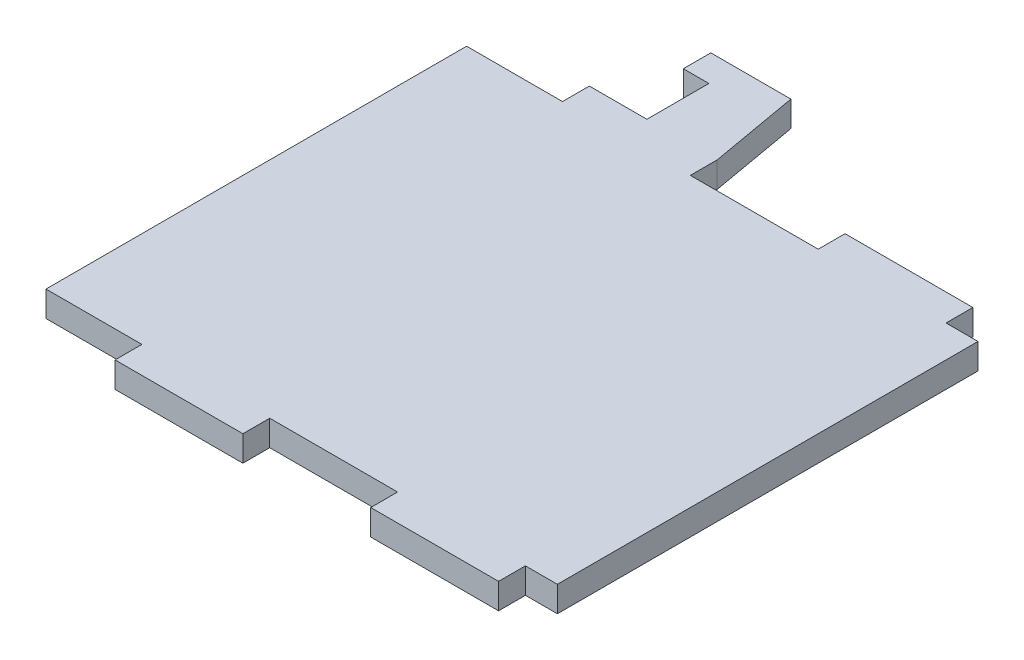
ISO-10303-21;
HEADER;
FILE_DESCRIPTION(('STEP AP214'),'2;1');
FILE_NAME('part.step','',(''),(''),'','','');
FILE_SCHEMA(('AUTOMOTIVE_DESIGN { 1 0 10303 214 1 1 1 1 }'));
ENDSEC;
DATA;
#1=APPLICATION_CONTEXT('core data for automotive mechanical design processes');
#2=APPLICATION_PROTOCOL_DEFINITION('international standard','automotive_design',2000,#1);
#3=PRODUCT_CONTEXT('',#1,'mechanical');
#4=PRODUCT('Part','Part','',(#3));
#5=PRODUCT_RELATED_PRODUCT_CATEGORY('part','',(#4));
#6=PRODUCT_DEFINITION_FORMATION('','',#4);
#7=PRODUCT_DEFINITION_CONTEXT('part definition',#1,'design');
#8=PRODUCT_DEFINITION('design','',#6,#7);
#9=PRODUCT_DEFINITION_SHAPE('','',#8);
#10=(LENGTH_UNIT() NAMED_UNIT(*) SI_UNIT(.MILLI.,.METRE.));
#11=(NAMED_UNIT(*) PLANE_ANGLE_UNIT() SI_UNIT($,.RADIAN.));
#12=(NAMED_UNIT(*) SI_UNIT($,.STERADIAN.) SOLID_ANGLE_UNIT());
#13=UNCERTAINTY_MEASURE_WITH_UNIT(LENGTH_MEASURE(1.E-05),#10,'distance_accuracy_value','');
#14=(GEOMETRIC_REPRESENTATION_CONTEXT(3) GLOBAL_UNCERTAINTY_ASSIGNED_CONTEXT((#13)) GLOBAL_UNIT_ASSIGNED_CONTEXT((#10,
#11,#12)) REPRESENTATION_CONTEXT('',''));
#15=CARTESIAN_POINT('',(0.,0.,0.));
#16=DIRECTION('',(0.,0.,1.));
#17=DIRECTION('',(1.,0.,0.));
#18=AXIS2_PLACEMENT_3D('',#15,#16,#17);
#19=CARTESIAN_POINT('',(75.,4.,-65.8));
#20=DIRECTION('',(0.,0.,1.));
#21=DIRECTION('',(1.,0.,0.));
#22=AXIS2_PLACEMENT_3D('',#19,#20,#21);
#23=PLANE('',#22);
#24=DIRECTION('',(-1.,0.,0.));
#25=VECTOR('',#24,1.);
#26=CARTESIAN_POINT('',(75.,0.,-65.8));
#27=LINE('',#26,#25);
#28=CARTESIAN_POINT('',(80.,0.,-65.8));
#29=VERTEX_POINT('',#28);
#30=CARTESIAN_POINT('',(75.,0.,-65.8));
#31=VERTEX_POINT('',#30);
#32=EDGE_CURVE('E234',#29,#31,#27,.T.);
#33=ORIENTED_EDGE('',*,*,#32,.T.);
#34=DIRECTION('',(0.,-1.,0.));
#35=VECTOR('',#34,1.);
#36=CARTESIAN_POINT('',(75.,4.,-65.8));
#37=LINE('',#36,#35);
#38=CARTESIAN_POINT('',(75.,4.,-65.8));
#39=VERTEX_POINT('',#38);
#40=EDGE_CURVE('E11',#39,#31,#37,.T.);
#41=ORIENTED_EDGE('',*,*,#40,.F.);
#42=DIRECTION('',(-1.,0.,0.));
#43=VECTOR('',#42,1.);
#44=CARTESIAN_POINT('',(75.,4.,-65.8));
#45=LINE('',#44,#43);
#46=CARTESIAN_POINT('',(80.,4.,-65.8));
#47=VERTEX_POINT('',#46);
#48=EDGE_CURVE('E282',#47,#39,#45,.T.);
#49=ORIENTED_EDGE('',*,*,#48,.F.);
#50=DIRECTION('',(0.,-1.,0.));
#51=VECTOR('',#50,1.);
#52=CARTESIAN_POINT('',(80.,4.,-65.8));
#53=LINE('',#52,#51);
#54=EDGE_CURVE('E230',#47,#29,#53,.T.);
#55=ORIENTED_EDGE('',*,*,#54,.T.);
#56=EDGE_LOOP('',(#33,#41,#49,#55));
#57=FACE_BOUND('',#56,.T.);
#58=ADVANCED_FACE('F36',(#57),#23,.F.);
#59=CARTESIAN_POINT('',(75.,4.,-65.8));
#60=DIRECTION('',(-1.,0.,0.));
#61=DIRECTION('',(0.,0.,1.));
#62=AXIS2_PLACEMENT_3D('',#59,#60,#61);
#63=PLANE('',#62);
#64=DIRECTION('',(0.,0.,-1.));
#65=VECTOR('',#64,1.);
#66=CARTESIAN_POINT('',(75.,0.,-65.8));
#67=LINE('',#66,#65);
#68=CARTESIAN_POINT('',(75.,0.,-70.));
#69=VERTEX_POINT('',#68);
#70=EDGE_CURVE('E237',#31,#69,#67,.T.);
#71=ORIENTED_EDGE('',*,*,#70,.T.);
#72=DIRECTION('',(0.,-1.,0.));
#73=VECTOR('',#72,1.);
#74=CARTESIAN_POINT('',(75.,4.,-70.));
#75=LINE('',#74,#73);
#76=CARTESIAN_POINT('',(75.,4.,-70.));
#77=VERTEX_POINT('',#76);
#78=EDGE_CURVE('E44',#77,#69,#75,.T.);
#79=ORIENTED_EDGE('',*,*,#78,.F.);
#80=DIRECTION('',(0.,0.,-1.));
#81=VECTOR('',#80,1.);
#82=CARTESIAN_POINT('',(75.,4.,-65.8));
#83=LINE('',#82,#81);
#84=EDGE_CURVE('E146',#39,#77,#83,.T.);
#85=ORIENTED_EDGE('',*,*,#84,.F.);
#86=ORIENTED_EDGE('',*,*,#40,.T.);
#87=EDGE_LOOP('',(#71,#79,#85,#86));
#88=FACE_BOUND('',#87,.T.);
#89=ADVANCED_FACE('F425',(#88),#63,.F.);
#90=CARTESIAN_POINT('',(75.,4.,-70.));
#91=DIRECTION('',(0.,0.,1.));
#92=DIRECTION('',(1.,0.,0.));
#93=AXIS2_PLACEMENT_3D('',#90,#91,#92);
#94=PLANE('',#93);
#95=DIRECTION('',(-1.,0.,0.));
#96=VECTOR('',#95,1.);
#97=CARTESIAN_POINT('',(75.,0.,-70.));
#98=LINE('',#97,#96);
#99=CARTESIAN_POINT('',(55.,0.,-70.));
#100=VERTEX_POINT('',#99);
#101=EDGE_CURVE('E239',#69,#100,#98,.T.);
#102=ORIENTED_EDGE('',*,*,#101,.T.);
#103=DIRECTION('',(0.,-1.,0.));
#104=VECTOR('',#103,1.);
#105=CARTESIAN_POINT('',(55.,4.,-70.));
#106=LINE('',#105,#104);
#107=CARTESIAN_POINT('',(55.,4.,-70.));
#108=VERTEX_POINT('',#107);
#109=EDGE_CURVE('E340',#108,#100,#106,.T.);
#110=ORIENTED_EDGE('',*,*,#109,.F.);
#111=DIRECTION('',(-1.,0.,0.));
#112=VECTOR('',#111,1.);
#113=CARTESIAN_POINT('',(75.,4.,-70.));
#114=LINE('',#113,#112);
#115=EDGE_CURVE('E348',#77,#108,#114,.T.);
#116=ORIENTED_EDGE('',*,*,#115,.F.);
#117=ORIENTED_EDGE('',*,*,#78,.T.);
#118=EDGE_LOOP('',(#102,#110,#116,#117));
#119=FACE_BOUND('',#118,.T.);
#120=ADVANCED_FACE('F346',(#119),#94,.F.);
#121=CARTESIAN_POINT('',(55.,4.,-65.8));
#122=DIRECTION('',(1.,0.,0.));
#123=DIRECTION('',(0.,0.,-1.));
#124=AXIS2_PLACEMENT_3D('',#121,#122,#123);
#125=PLANE('',#124);
#126=DIRECTION('',(0.,0.,1.));
#127=VECTOR('',#126,1.);
#128=CARTESIAN_POINT('',(55.,0.,-65.8));
#129=LINE('',#128,#127);
#130=CARTESIAN_POINT('',(55.,0.,-65.8));
#131=VERTEX_POINT('',#130);
#132=EDGE_CURVE('E241',#100,#131,#129,.T.);
#133=ORIENTED_EDGE('',*,*,#132,.T.);
#134=DIRECTION('',(0.,-1.,0.));
#135=VECTOR('',#134,1.);
#136=CARTESIAN_POINT('',(55.,4.,-65.8));
#137=LINE('',#136,#135);
#138=CARTESIAN_POINT('',(55.,4.,-65.8));
#139=VERTEX_POINT('',#138);
#140=EDGE_CURVE('E337',#139,#131,#137,.T.);
#141=ORIENTED_EDGE('',*,*,#140,.F.);
#142=DIRECTION('',(0.,0.,1.));
#143=VECTOR('',#142,1.);
#144=CARTESIAN_POINT('',(55.,4.,-65.8));
#145=LINE('',#144,#143);
#146=EDGE_CURVE('E366',#108,#139,#145,.T.);
#147=ORIENTED_EDGE('',*,*,#146,.F.);
#148=ORIENTED_EDGE('',*,*,#109,.T.);
#149=EDGE_LOOP('',(#133,#141,#147,#148));
#150=FACE_BOUND('',#149,.T.);
#151=ADVANCED_FACE('F357',(#150),#125,.F.);
#152=CARTESIAN_POINT('',(35.,4.,-65.8));
#153=DIRECTION('',(0.,0.,1.));
#154=DIRECTION('',(1.,0.,0.));
#155=AXIS2_PLACEMENT_3D('',#152,#153,#154);
#156=PLANE('',#155);
#157=DIRECTION('',(-1.,0.,0.));
#158=VECTOR('',#157,1.);
#159=CARTESIAN_POINT('',(35.,0.,-65.8));
#160=LINE('',#159,#158);
#161=CARTESIAN_POINT('',(35.,0.,-65.8));
#162=VERTEX_POINT('',#161);
#163=EDGE_CURVE('E243',#131,#162,#160,.T.);
#164=ORIENTED_EDGE('',*,*,#163,.T.);
#165=DIRECTION('',(0.,-1.,0.));
#166=VECTOR('',#165,1.);
#167=CARTESIAN_POINT('',(35.,4.,-65.8));
#168=LINE('',#167,#166);
#169=CARTESIAN_POINT('',(35.,4.,-65.8));
#170=VERTEX_POINT('',#169);
#171=EDGE_CURVE('E334',#170,#162,#168,.T.);
#172=ORIENTED_EDGE('',*,*,#171,.F.);
#173=DIRECTION('',(-1.,0.,0.));
#174=VECTOR('',#173,1.);
#175=CARTESIAN_POINT('',(35.,4.,-65.8));
#176=LINE('',#175,#174);
#177=EDGE_CURVE('E363',#139,#170,#176,.T.);
#178=ORIENTED_EDGE('',*,*,#177,.F.);
#179=ORIENTED_EDGE('',*,*,#140,.T.);
#180=EDGE_LOOP('',(#164,#172,#178,#179));
#181=FACE_BOUND('',#180,.T.);
#182=ADVANCED_FACE('F361',(#181),#156,.F.);
#183=CARTESIAN_POINT('',(35.,4.,-65.8));
#184=DIRECTION('',(-1.,0.,0.));
#185=DIRECTION('',(0.,0.,1.));
#186=AXIS2_PLACEMENT_3D('',#183,#184,#185);
#187=PLANE('',#186);
#188=DIRECTION('',(0.,0.,-1.));
#189=VECTOR('',#188,1.);
#190=CARTESIAN_POINT('',(35.,0.,-65.8));
#191=LINE('',#190,#189);
#192=CARTESIAN_POINT('',(35.,0.,-70.));
#193=VERTEX_POINT('',#192);
#194=EDGE_CURVE('E245',#162,#193,#191,.T.);
#195=ORIENTED_EDGE('',*,*,#194,.T.);
#196=DIRECTION('',(0.,-1.,0.));
#197=VECTOR('',#196,1.);
#198=CARTESIAN_POINT('',(35.,4.,-70.));
#199=LINE('',#198,#197);
#200=CARTESIAN_POINT('',(35.,4.,-70.));
#201=VERTEX_POINT('',#200);
#202=EDGE_CURVE('E331',#201,#193,#199,.T.);
#203=ORIENTED_EDGE('',*,*,#202,.F.);
#204=DIRECTION('',(0.,0.,-1.));
#205=VECTOR('',#204,1.);
#206=CARTESIAN_POINT('',(35.,4.,-65.8));
#207=LINE('',#206,#205);
#208=EDGE_CURVE('E365',#170,#201,#207,.T.);
#209=ORIENTED_EDGE('',*,*,#208,.F.);
#210=ORIENTED_EDGE('',*,*,#171,.T.);
#211=EDGE_LOOP('',(#195,#203,#209,#210));
#212=FACE_BOUND('',#211,.T.);
#213=ADVANCED_FACE('F438',(#212),#187,.F.);
#214=CARTESIAN_POINT('',(32.5314222700815,4.,-84.));
#215=DIRECTION('',(-0.984807753012209,0.,0.173648177666927));
#216=DIRECTION('',(0.173648177666927,0.,0.984807753012209));
#217=AXIS2_PLACEMENT_3D('',#214,#215,#216);
#218=PLANE('',#217);
#219=DIRECTION('',(-0.173648177666927,0.,-0.984807753012209));
#220=VECTOR('',#219,1.);
#221=CARTESIAN_POINT('',(32.5314222700815,0.,-84.));
#222=LINE('',#221,#220);
#223=CARTESIAN_POINT('',(32.5314222700815,0.,-84.));
#224=VERTEX_POINT('',#223);
#225=EDGE_CURVE('E247',#193,#224,#222,.T.);
#226=ORIENTED_EDGE('',*,*,#225,.T.);
#227=DIRECTION('',(0.,-1.,0.));
#228=VECTOR('',#227,1.);
#229=CARTESIAN_POINT('',(32.5314222700815,4.,-84.));
#230=LINE('',#229,#228);
#231=CARTESIAN_POINT('',(32.5314222700815,4.,-84.));
#232=VERTEX_POINT('',#231);
#233=EDGE_CURVE('E328',#232,#224,#230,.T.);
#234=ORIENTED_EDGE('',*,*,#233,.F.);
#235=DIRECTION('',(-0.173648177666927,0.,-0.984807753012209));
#236=VECTOR('',#235,1.);
#237=CARTESIAN_POINT('',(32.5314222700815,4.,-84.));
#238=LINE('',#237,#236);
#239=EDGE_CURVE('E368',#201,#232,#238,.T.);
#240=ORIENTED_EDGE('',*,*,#239,.F.);
#241=ORIENTED_EDGE('',*,*,#202,.T.);
#242=EDGE_LOOP('',(#226,#234,#240,#241));
#243=FACE_BOUND('',#242,.T.);
#244=ADVANCED_FACE('F441',(#243),#218,.F.);
#245=CARTESIAN_POINT('',(20.,4.,-84.));
#246=DIRECTION('',(0.,0.,1.));
#247=DIRECTION('',(1.,0.,0.));
#248=AXIS2_PLACEMENT_3D('',#245,#246,#247);
#249=PLANE('',#248);
#250=DIRECTION('',(-1.,0.,0.));
#251=VECTOR('',#250,1.);
#252=CARTESIAN_POINT('',(20.,0.,-84.));
#253=LINE('',#252,#251);
#254=CARTESIAN_POINT('',(20.,0.,-84.));
#255=VERTEX_POINT('',#254);
#256=EDGE_CURVE('E249',#224,#255,#253,.T.);
#257=ORIENTED_EDGE('',*,*,#256,.T.);
#258=DIRECTION('',(0.,-1.,0.));
#259=VECTOR('',#258,1.);
#260=CARTESIAN_POINT('',(20.,4.,-84.));
#261=LINE('',#260,#259);
#262=CARTESIAN_POINT('',(20.,4.,-84.));
#263=VERTEX_POINT('',#262);
#264=EDGE_CURVE('E325',#263,#255,#261,.T.);
#265=ORIENTED_EDGE('',*,*,#264,.F.);
#266=DIRECTION('',(-1.,0.,0.));
#267=VECTOR('',#266,1.);
#268=CARTESIAN_POINT('',(20.,4.,-84.));
#269=LINE('',#268,#267);
#270=EDGE_CURVE('E374',#232,#263,#269,.T.);
#271=ORIENTED_EDGE('',*,*,#270,.F.);
#272=ORIENTED_EDGE('',*,*,#233,.T.);
#273=EDGE_LOOP('',(#257,#265,#271,#272));
#274=FACE_BOUND('',#273,.T.);
#275=ADVANCED_FACE('F445',(#274),#249,.F.);
#276=CARTESIAN_POINT('',(20.,4.,-79.7));
#277=DIRECTION('',(1.,0.,0.));
#278=DIRECTION('',(0.,0.,-1.));
#279=AXIS2_PLACEMENT_3D('',#276,#277,#278);
#280=PLANE('',#279);
#281=DIRECTION('',(0.,0.,1.));
#282=VECTOR('',#281,1.);
#283=CARTESIAN_POINT('',(20.,0.,-79.7));
#284=LINE('',#283,#282);
#285=CARTESIAN_POINT('',(20.,0.,-79.7));
#286=VERTEX_POINT('',#285);
#287=EDGE_CURVE('E251',#255,#286,#284,.T.);
#288=ORIENTED_EDGE('',*,*,#287,.T.);
#289=DIRECTION('',(0.,-1.,0.));
#290=VECTOR('',#289,1.);
#291=CARTESIAN_POINT('',(20.,4.,-79.7));
#292=LINE('',#291,#290);
#293=CARTESIAN_POINT('',(20.,4.,-79.7));
#294=VERTEX_POINT('',#293);
#295=EDGE_CURVE('E322',#294,#286,#292,.T.);
#296=ORIENTED_EDGE('',*,*,#295,.F.);
#297=DIRECTION('',(0.,0.,1.));
#298=VECTOR('',#297,1.);
#299=CARTESIAN_POINT('',(20.,4.,-79.7));
#300=LINE('',#299,#298);
#301=EDGE_CURVE('E376',#263,#294,#300,.T.);
#302=ORIENTED_EDGE('',*,*,#301,.F.);
#303=ORIENTED_EDGE('',*,*,#264,.T.);
#304=EDGE_LOOP('',(#288,#296,#302,#303));
#305=FACE_BOUND('',#304,.T.);
#306=ADVANCED_FACE('F449',(#305),#280,.F.);
#307=CARTESIAN_POINT('',(24.,4.,-79.7));
#308=DIRECTION('',(0.,0.,-1.));
#309=DIRECTION('',(-1.,0.,0.));
#310=AXIS2_PLACEMENT_3D('',#307,#308,#309);
#311=PLANE('',#310);
#312=DIRECTION('',(1.,0.,0.));
#313=VECTOR('',#312,1.);
#314=CARTESIAN_POINT('',(24.,0.,-79.7));
#315=LINE('',#314,#313);
#316=CARTESIAN_POINT('',(24.,0.,-79.7));
#317=VERTEX_POINT('',#316);
#318=EDGE_CURVE('E253',#286,#317,#315,.T.);
#319=ORIENTED_EDGE('',*,*,#318,.T.);
#320=DIRECTION('',(0.,-1.,0.));
#321=VECTOR('',#320,1.);
#322=CARTESIAN_POINT('',(24.,4.,-79.7));
#323=LINE('',#322,#321);
#324=CARTESIAN_POINT('',(24.,4.,-79.7));
#325=VERTEX_POINT('',#324);
#326=EDGE_CURVE('E319',#325,#317,#323,.T.);
#327=ORIENTED_EDGE('',*,*,#326,.F.);
#328=DIRECTION('',(1.,0.,0.));
#329=VECTOR('',#328,1.);
#330=CARTESIAN_POINT('',(24.,4.,-79.7));
#331=LINE('',#330,#329);
#332=EDGE_CURVE('E378',#294,#325,#331,.T.);
#333=ORIENTED_EDGE('',*,*,#332,.F.);
#334=ORIENTED_EDGE('',*,*,#295,.T.);
#335=EDGE_LOOP('',(#319,#327,#333,#334));
#336=FACE_BOUND('',#335,.T.);
#337=ADVANCED_FACE('F453',(#336),#311,.F.);
#338=CARTESIAN_POINT('',(24.,4.,-70.));
#339=DIRECTION('',(1.,0.,0.));
#340=DIRECTION('',(0.,0.,-1.));
#341=AXIS2_PLACEMENT_3D('',#338,#339,#340);
#342=PLANE('',#341);
#343=DIRECTION('',(0.,0.,1.));
#344=VECTOR('',#343,1.);
#345=CARTESIAN_POINT('',(24.,0.,-70.));
#346=LINE('',#345,#344);
#347=CARTESIAN_POINT('',(24.,0.,-70.));
#348=VERTEX_POINT('',#347);
#349=EDGE_CURVE('E255',#317,#348,#346,.T.);
#350=ORIENTED_EDGE('',*,*,#349,.T.);
#351=DIRECTION('',(0.,-1.,0.));
#352=VECTOR('',#351,1.);
#353=CARTESIAN_POINT('',(24.,4.,-70.));
#354=LINE('',#353,#352);
#355=CARTESIAN_POINT('',(24.,4.,-70.));
#356=VERTEX_POINT('',#355);
#357=EDGE_CURVE('E316',#356,#348,#354,.T.);
#358=ORIENTED_EDGE('',*,*,#357,.F.);
#359=DIRECTION('',(0.,0.,1.));
#360=VECTOR('',#359,1.);
#361=CARTESIAN_POINT('',(24.,4.,-70.));
#362=LINE('',#361,#360);
#363=EDGE_CURVE('E380',#325,#356,#362,.T.);
#364=ORIENTED_EDGE('',*,*,#363,.F.);
#365=ORIENTED_EDGE('',*,*,#326,.T.);
#366=EDGE_LOOP('',(#350,#358,#364,#365));
#367=FACE_BOUND('',#366,.T.);
#368=ADVANCED_FACE('F457',(#367),#342,.F.);
#369=CARTESIAN_POINT('',(24.,4.,-70.));
#370=DIRECTION('',(0.,0.,1.));
#371=DIRECTION('',(1.,0.,0.));
#372=AXIS2_PLACEMENT_3D('',#369,#370,#371);
#373=PLANE('',#372);
#374=DIRECTION('',(-1.,0.,0.));
#375=VECTOR('',#374,1.);
#376=CARTESIAN_POINT('',(24.,0.,-70.));
#377=LINE('',#376,#375);
#378=CARTESIAN_POINT('',(15.,0.,-70.));
#379=VERTEX_POINT('',#378);
#380=EDGE_CURVE('E257',#348,#379,#377,.T.);
#381=ORIENTED_EDGE('',*,*,#380,.T.);
#382=DIRECTION('',(0.,-1.,0.));
#383=VECTOR('',#382,1.);
#384=CARTESIAN_POINT('',(15.,4.,-70.));
#385=LINE('',#384,#383);
#386=CARTESIAN_POINT('',(15.,4.,-70.));
#387=VERTEX_POINT('',#386);
#388=EDGE_CURVE('E313',#387,#379,#385,.T.);
#389=ORIENTED_EDGE('',*,*,#388,.F.);
#390=DIRECTION('',(-1.,0.,0.));
#391=VECTOR('',#390,1.);
#392=CARTESIAN_POINT('',(24.,4.,-70.));
#393=LINE('',#392,#391);
#394=EDGE_CURVE('E382',#356,#387,#393,.T.);
#395=ORIENTED_EDGE('',*,*,#394,.F.);
#396=ORIENTED_EDGE('',*,*,#357,.T.);
#397=EDGE_LOOP('',(#381,#389,#395,#396));
#398=FACE_BOUND('',#397,.T.);
#399=ADVANCED_FACE('F461',(#398),#373,.F.);
#400=CARTESIAN_POINT('',(15.,4.,-65.8));
#401=DIRECTION('',(1.,0.,0.));
#402=DIRECTION('',(0.,0.,-1.));
#403=AXIS2_PLACEMENT_3D('',#400,#401,#402);
#404=PLANE('',#403);
#405=DIRECTION('',(0.,0.,1.));
#406=VECTOR('',#405,1.);
#407=CARTESIAN_POINT('',(15.,0.,-65.8));
#408=LINE('',#407,#406);
#409=CARTESIAN_POINT('',(15.,0.,-65.8));
#410=VERTEX_POINT('',#409);
#411=EDGE_CURVE('E259',#379,#410,#408,.T.);
#412=ORIENTED_EDGE('',*,*,#411,.T.);
#413=DIRECTION('',(0.,-1.,0.));
#414=VECTOR('',#413,1.);
#415=CARTESIAN_POINT('',(15.,4.,-65.8));
#416=LINE('',#415,#414);
#417=CARTESIAN_POINT('',(15.,4.,-65.8));
#418=VERTEX_POINT('',#417);
#419=EDGE_CURVE('E310',#418,#410,#416,.T.);
#420=ORIENTED_EDGE('',*,*,#419,.F.);
#421=DIRECTION('',(0.,0.,1.));
#422=VECTOR('',#421,1.);
#423=CARTESIAN_POINT('',(15.,4.,-65.8));
#424=LINE('',#423,#422);
#425=EDGE_CURVE('E384',#387,#418,#424,.T.);
#426=ORIENTED_EDGE('',*,*,#425,.F.);
#427=ORIENTED_EDGE('',*,*,#388,.T.);
#428=EDGE_LOOP('',(#412,#420,#426,#427));
#429=FACE_BOUND('',#428,.T.);
#430=ADVANCED_FACE('F465',(#429),#404,.F.);
#431=CARTESIAN_POINT('',(0.,4.,-65.8));
#432=DIRECTION('',(0.,0.,1.));
#433=DIRECTION('',(1.,0.,0.));
#434=AXIS2_PLACEMENT_3D('',#431,#432,#433);
#435=PLANE('',#434);
#436=DIRECTION('',(-1.,0.,0.));
#437=VECTOR('',#436,1.);
#438=CARTESIAN_POINT('',(0.,0.,-65.8));
#439=LINE('',#438,#437);
#440=CARTESIAN_POINT('',(0.,0.,-65.8));
#441=VERTEX_POINT('',#440);
#442=EDGE_CURVE('E261',#410,#441,#439,.T.);
#443=ORIENTED_EDGE('',*,*,#442,.T.);
#444=DIRECTION('',(0.,-1.,0.));
#445=VECTOR('',#444,1.);
#446=CARTESIAN_POINT('',(0.,4.,-65.8));
#447=LINE('',#446,#445);
#448=CARTESIAN_POINT('',(0.,4.,-65.8));
#449=VERTEX_POINT('',#448);
#450=EDGE_CURVE('E307',#449,#441,#447,.T.);
#451=ORIENTED_EDGE('',*,*,#450,.F.);
#452=DIRECTION('',(-1.,0.,0.));
#453=VECTOR('',#452,1.);
#454=CARTESIAN_POINT('',(0.,4.,-65.8));
#455=LINE('',#454,#453);
#456=EDGE_CURVE('E386',#418,#449,#455,.T.);
#457=ORIENTED_EDGE('',*,*,#456,.F.);
#458=ORIENTED_EDGE('',*,*,#419,.T.);
#459=EDGE_LOOP('',(#443,#451,#457,#458));
#460=FACE_BOUND('',#459,.T.);
#461=ADVANCED_FACE('F469',(#460),#435,.F.);
#462=CARTESIAN_POINT('',(0.,4.,0.));
#463=DIRECTION('',(1.,0.,0.));
#464=DIRECTION('',(0.,0.,-1.));
#465=AXIS2_PLACEMENT_3D('',#462,#463,#464);
#466=PLANE('',#465);
#467=DIRECTION('',(0.,0.,1.));
#468=VECTOR('',#467,1.);
#469=CARTESIAN_POINT('',(0.,0.,0.));
#470=LINE('',#469,#468);
#471=CARTESIAN_POINT('',(0.,0.,0.));
#472=VERTEX_POINT('',#471);
#473=EDGE_CURVE('E263',#441,#472,#470,.T.);
#474=ORIENTED_EDGE('',*,*,#473,.T.);
#475=DIRECTION('',(0.,-1.,0.));
#476=VECTOR('',#475,1.);
#477=CARTESIAN_POINT('',(0.,4.,0.));
#478=LINE('',#477,#476);
#479=CARTESIAN_POINT('',(0.,4.,0.));
#480=VERTEX_POINT('',#479);
#481=EDGE_CURVE('E304',#480,#472,#478,.T.);
#482=ORIENTED_EDGE('',*,*,#481,.F.);
#483=DIRECTION('',(0.,0.,1.));
#484=VECTOR('',#483,1.);
#485=CARTESIAN_POINT('',(0.,4.,0.));
#486=LINE('',#485,#484);
#487=EDGE_CURVE('E388',#449,#480,#486,.T.);
#488=ORIENTED_EDGE('',*,*,#487,.F.);
#489=ORIENTED_EDGE('',*,*,#450,.T.);
#490=EDGE_LOOP('',(#474,#482,#488,#489));
#491=FACE_BOUND('',#490,.T.);
#492=ADVANCED_FACE('F473',(#491),#466,.F.);
#493=CARTESIAN_POINT('',(0.,4.,0.));
#494=DIRECTION('',(0.,0.,-1.));
#495=DIRECTION('',(-1.,0.,0.));
#496=AXIS2_PLACEMENT_3D('',#493,#494,#495);
#497=PLANE('',#496);
#498=DIRECTION('',(1.,0.,0.));
#499=VECTOR('',#498,1.);
#500=CARTESIAN_POINT('',(0.,0.,0.));
#501=LINE('',#500,#499);
#502=CARTESIAN_POINT('',(15.,0.,0.));
#503=VERTEX_POINT('',#502);
#504=EDGE_CURVE('E265',#472,#503,#501,.T.);
#505=ORIENTED_EDGE('',*,*,#504,.T.);
#506=DIRECTION('',(0.,-1.,0.));
#507=VECTOR('',#506,1.);
#508=CARTESIAN_POINT('',(15.,4.,0.));
#509=LINE('',#508,#507);
#510=CARTESIAN_POINT('',(15.,4.,0.));
#511=VERTEX_POINT('',#510);
#512=EDGE_CURVE('E301',#511,#503,#509,.T.);
#513=ORIENTED_EDGE('',*,*,#512,.F.);
#514=DIRECTION('',(1.,0.,0.));
#515=VECTOR('',#514,1.);
#516=CARTESIAN_POINT('',(0.,4.,0.));
#517=LINE('',#516,#515);
#518=EDGE_CURVE('E390',#480,#511,#517,.T.);
#519=ORIENTED_EDGE('',*,*,#518,.F.);
#520=ORIENTED_EDGE('',*,*,#481,.T.);
#521=EDGE_LOOP('',(#505,#513,#519,#520));
#522=FACE_BOUND('',#521,.T.);
#523=ADVANCED_FACE('F477',(#522),#497,.F.);
#524=CARTESIAN_POINT('',(15.,4.,0.));
#525=DIRECTION('',(1.,0.,0.));
#526=DIRECTION('',(0.,0.,-1.));
#527=AXIS2_PLACEMENT_3D('',#524,#525,#526);
#528=PLANE('',#527);
#529=DIRECTION('',(0.,0.,1.));
#530=VECTOR('',#529,1.);
#531=CARTESIAN_POINT('',(15.,0.,0.));
#532=LINE('',#531,#530);
#533=CARTESIAN_POINT('',(15.,0.,4.2));
#534=VERTEX_POINT('',#533);
#535=EDGE_CURVE('E267',#503,#534,#532,.T.);
#536=ORIENTED_EDGE('',*,*,#535,.T.);
#537=DIRECTION('',(0.,-1.,0.));
#538=VECTOR('',#537,1.);
#539=CARTESIAN_POINT('',(15.,4.,4.2));
#540=LINE('',#539,#538);
#541=CARTESIAN_POINT('',(15.,4.,4.2));
#542=VERTEX_POINT('',#541);
#543=EDGE_CURVE('E298',#542,#534,#540,.T.);
#544=ORIENTED_EDGE('',*,*,#543,.F.);
#545=DIRECTION('',(0.,0.,1.));
#546=VECTOR('',#545,1.);
#547=CARTESIAN_POINT('',(15.,4.,0.));
#548=LINE('',#547,#546);
#549=EDGE_CURVE('E392',#511,#542,#548,.T.);
#550=ORIENTED_EDGE('',*,*,#549,.F.);
#551=ORIENTED_EDGE('',*,*,#512,.T.);
#552=EDGE_LOOP('',(#536,#544,#550,#551));
#553=FACE_BOUND('',#552,.T.);
#554=ADVANCED_FACE('F481',(#553),#528,.F.);
#555=CARTESIAN_POINT('',(15.,4.,4.2));
#556=DIRECTION('',(0.,0.,-1.));
#557=DIRECTION('',(-1.,0.,0.));
#558=AXIS2_PLACEMENT_3D('',#555,#556,#557);
#559=PLANE('',#558);
#560=DIRECTION('',(1.,0.,0.));
#561=VECTOR('',#560,1.);
#562=CARTESIAN_POINT('',(15.,0.,4.2));
#563=LINE('',#562,#561);
#564=CARTESIAN_POINT('',(35.,0.,4.2));
#565=VERTEX_POINT('',#564);
#566=EDGE_CURVE('E269',#534,#565,#563,.T.);
#567=ORIENTED_EDGE('',*,*,#566,.T.);
#568=DIRECTION('',(0.,-1.,0.));
#569=VECTOR('',#568,1.);
#570=CARTESIAN_POINT('',(35.,4.,4.2));
#571=LINE('',#570,#569);
#572=CARTESIAN_POINT('',(35.,4.,4.2));
#573=VERTEX_POINT('',#572);
#574=EDGE_CURVE('E295',#573,#565,#571,.T.);
#575=ORIENTED_EDGE('',*,*,#574,.F.);
#576=DIRECTION('',(1.,0.,0.));
#577=VECTOR('',#576,1.);
#578=CARTESIAN_POINT('',(15.,4.,4.2));
#579=LINE('',#578,#577);
#580=EDGE_CURVE('E394',#542,#573,#579,.T.);
#581=ORIENTED_EDGE('',*,*,#580,.F.);
#582=ORIENTED_EDGE('',*,*,#543,.T.);
#583=EDGE_LOOP('',(#567,#575,#581,#582));
#584=FACE_BOUND('',#583,.T.);
#585=ADVANCED_FACE('F485',(#584),#559,.F.);
#586=CARTESIAN_POINT('',(35.,4.,0.));
#587=DIRECTION('',(-1.,0.,0.));
#588=DIRECTION('',(0.,0.,1.));
#589=AXIS2_PLACEMENT_3D('',#586,#587,#588);
#590=PLANE('',#589);
#591=DIRECTION('',(0.,0.,-1.));
#592=VECTOR('',#591,1.);
#593=CARTESIAN_POINT('',(35.,0.,0.));
#594=LINE('',#593,#592);
#595=CARTESIAN_POINT('',(35.,0.,0.));
#596=VERTEX_POINT('',#595);
#597=EDGE_CURVE('E271',#565,#596,#594,.T.);
#598=ORIENTED_EDGE('',*,*,#597,.T.);
#599=DIRECTION('',(0.,-1.,0.));
#600=VECTOR('',#599,1.);
#601=CARTESIAN_POINT('',(35.,4.,0.));
#602=LINE('',#601,#600);
#603=CARTESIAN_POINT('',(35.,4.,0.));
#604=VERTEX_POINT('',#603);
#605=EDGE_CURVE('E292',#604,#596,#602,.T.);
#606=ORIENTED_EDGE('',*,*,#605,.F.);
#607=DIRECTION('',(0.,0.,-1.));
#608=VECTOR('',#607,1.);
#609=CARTESIAN_POINT('',(35.,4.,0.));
#610=LINE('',#609,#608);
#611=EDGE_CURVE('E396',#573,#604,#610,.T.);
#612=ORIENTED_EDGE('',*,*,#611,.F.);
#613=ORIENTED_EDGE('',*,*,#574,.T.);
#614=EDGE_LOOP('',(#598,#606,#612,#613));
#615=FACE_BOUND('',#614,.T.);
#616=ADVANCED_FACE('F489',(#615),#590,.F.);
#617=CARTESIAN_POINT('',(35.,4.,0.));
#618=DIRECTION('',(0.,0.,-1.));
#619=DIRECTION('',(-1.,0.,0.));
#620=AXIS2_PLACEMENT_3D('',#617,#618,#619);
#621=PLANE('',#620);
#622=DIRECTION('',(1.,0.,0.));
#623=VECTOR('',#622,1.);
#624=CARTESIAN_POINT('',(35.,0.,0.));
#625=LINE('',#624,#623);
#626=CARTESIAN_POINT('',(55.,0.,0.));
#627=VERTEX_POINT('',#626);
#628=EDGE_CURVE('E273',#596,#627,#625,.T.);
#629=ORIENTED_EDGE('',*,*,#628,.T.);
#630=DIRECTION('',(0.,-1.,0.));
#631=VECTOR('',#630,1.);
#632=CARTESIAN_POINT('',(55.,4.,0.));
#633=LINE('',#632,#631);
#634=CARTESIAN_POINT('',(55.,4.,0.));
#635=VERTEX_POINT('',#634);
#636=EDGE_CURVE('E289',#635,#627,#633,.T.);
#637=ORIENTED_EDGE('',*,*,#636,.F.);
#638=DIRECTION('',(1.,0.,0.));
#639=VECTOR('',#638,1.);
#640=CARTESIAN_POINT('',(35.,4.,0.));
#641=LINE('',#640,#639);
#642=EDGE_CURVE('E398',#604,#635,#641,.T.);
#643=ORIENTED_EDGE('',*,*,#642,.F.);
#644=ORIENTED_EDGE('',*,*,#605,.T.);
#645=EDGE_LOOP('',(#629,#637,#643,#644));
#646=FACE_BOUND('',#645,.T.);
#647=ADVANCED_FACE('F493',(#646),#621,.F.);
#648=CARTESIAN_POINT('',(55.,4.,0.));
#649=DIRECTION('',(1.,0.,0.));
#650=DIRECTION('',(0.,0.,-1.));
#651=AXIS2_PLACEMENT_3D('',#648,#649,#650);
#652=PLANE('',#651);
#653=DIRECTION('',(0.,0.,1.));
#654=VECTOR('',#653,1.);
#655=CARTESIAN_POINT('',(55.,0.,0.));
#656=LINE('',#655,#654);
#657=CARTESIAN_POINT('',(55.,0.,4.19999999999999));
#658=VERTEX_POINT('',#657);
#659=EDGE_CURVE('E275',#627,#658,#656,.T.);
#660=ORIENTED_EDGE('',*,*,#659,.T.);
#661=DIRECTION('',(0.,-1.,0.));
#662=VECTOR('',#661,1.);
#663=CARTESIAN_POINT('',(55.,4.,4.19999999999999));
#664=LINE('',#663,#662);
#665=CARTESIAN_POINT('',(55.,4.,4.19999999999999));
#666=VERTEX_POINT('',#665);
#667=EDGE_CURVE('E286',#666,#658,#664,.T.);
#668=ORIENTED_EDGE('',*,*,#667,.F.);
#669=DIRECTION('',(0.,0.,1.));
#670=VECTOR('',#669,1.);
#671=CARTESIAN_POINT('',(55.,4.,0.));
#672=LINE('',#671,#670);
#673=EDGE_CURVE('E400',#635,#666,#672,.T.);
#674=ORIENTED_EDGE('',*,*,#673,.F.);
#675=ORIENTED_EDGE('',*,*,#636,.T.);
#676=EDGE_LOOP('',(#660,#668,#674,#675));
#677=FACE_BOUND('',#676,.T.);
#678=ADVANCED_FACE('F406',(#677),#652,.F.);
#679=CARTESIAN_POINT('',(75.,4.,4.19999999999999));
#680=DIRECTION('',(0.,0.,-1.));
#681=DIRECTION('',(-1.,0.,0.));
#682=AXIS2_PLACEMENT_3D('',#679,#680,#681);
#683=PLANE('',#682);
#684=DIRECTION('',(1.,0.,0.));
#685=VECTOR('',#684,1.);
#686=CARTESIAN_POINT('',(75.,0.,4.19999999999999));
#687=LINE('',#686,#685);
#688=CARTESIAN_POINT('',(75.,0.,4.19999999999999));
#689=VERTEX_POINT('',#688);
#690=EDGE_CURVE('E277',#658,#689,#687,.T.);
#691=ORIENTED_EDGE('',*,*,#690,.T.);
#692=DIRECTION('',(0.,-1.,0.));
#693=VECTOR('',#692,1.);
#694=CARTESIAN_POINT('',(75.,4.,4.19999999999999));
#695=LINE('',#694,#693);
#696=CARTESIAN_POINT('',(75.,4.,4.19999999999999));
#697=VERTEX_POINT('',#696);
#698=EDGE_CURVE('E225',#697,#689,#695,.T.);
#699=ORIENTED_EDGE('',*,*,#698,.F.);
#700=DIRECTION('',(1.,0.,0.));
#701=VECTOR('',#700,1.);
#702=CARTESIAN_POINT('',(75.,4.,4.19999999999999));
#703=LINE('',#702,#701);
#704=EDGE_CURVE('E216',#666,#697,#703,.T.);
#705=ORIENTED_EDGE('',*,*,#704,.F.);
#706=ORIENTED_EDGE('',*,*,#667,.T.);
#707=EDGE_LOOP('',(#691,#699,#705,#706));
#708=FACE_BOUND('',#707,.T.);
#709=ADVANCED_FACE('F410',(#708),#683,.F.);
#710=CARTESIAN_POINT('',(75.,4.,0.));
#711=DIRECTION('',(-1.,0.,0.));
#712=DIRECTION('',(0.,0.,1.));
#713=AXIS2_PLACEMENT_3D('',#710,#711,#712);
#714=PLANE('',#713);
#715=DIRECTION('',(0.,0.,-1.));
#716=VECTOR('',#715,1.);
#717=CARTESIAN_POINT('',(75.,0.,0.));
#718=LINE('',#717,#716);
#719=CARTESIAN_POINT('',(75.,0.,0.));
#720=VERTEX_POINT('',#719);
#721=EDGE_CURVE('E224',#689,#720,#718,.T.);
#722=ORIENTED_EDGE('',*,*,#721,.T.);
#723=DIRECTION('',(0.,-1.,0.));
#724=VECTOR('',#723,1.);
#725=CARTESIAN_POINT('',(75.,4.,0.));
#726=LINE('',#725,#724);
#727=CARTESIAN_POINT('',(75.,4.,0.));
#728=VERTEX_POINT('',#727);
#729=EDGE_CURVE('E221',#728,#720,#726,.T.);
#730=ORIENTED_EDGE('',*,*,#729,.F.);
#731=DIRECTION('',(0.,0.,-1.));
#732=VECTOR('',#731,1.);
#733=CARTESIAN_POINT('',(75.,4.,0.));
#734=LINE('',#733,#732);
#735=EDGE_CURVE('E210',#697,#728,#734,.T.);
#736=ORIENTED_EDGE('',*,*,#735,.F.);
#737=ORIENTED_EDGE('',*,*,#698,.T.);
#738=EDGE_LOOP('',(#722,#730,#736,#737));
#739=FACE_BOUND('',#738,.T.);
#740=ADVANCED_FACE('F222',(#739),#714,.F.);
#741=CARTESIAN_POINT('',(75.,4.,0.));
#742=DIRECTION('',(0.,0.,-1.));
#743=DIRECTION('',(-1.,0.,0.));
#744=AXIS2_PLACEMENT_3D('',#741,#742,#743);
#745=PLANE('',#744);
#746=DIRECTION('',(1.,0.,0.));
#747=VECTOR('',#746,1.);
#748=CARTESIAN_POINT('',(75.,0.,0.));
#749=LINE('',#748,#747);
#750=CARTESIAN_POINT('',(80.,0.,0.));
#751=VERTEX_POINT('',#750);
#752=EDGE_CURVE('E132',#720,#751,#749,.T.);
#753=ORIENTED_EDGE('',*,*,#752,.T.);
#754=DIRECTION('',(0.,-1.,0.));
#755=VECTOR('',#754,1.);
#756=CARTESIAN_POINT('',(80.,4.,0.));
#757=LINE('',#756,#755);
#758=CARTESIAN_POINT('',(80.,4.,0.));
#759=VERTEX_POINT('',#758);
#760=EDGE_CURVE('E226',#759,#751,#757,.T.);
#761=ORIENTED_EDGE('',*,*,#760,.F.);
#762=DIRECTION('',(1.,0.,0.));
#763=VECTOR('',#762,1.);
#764=CARTESIAN_POINT('',(75.,4.,0.));
#765=LINE('',#764,#763);
#766=EDGE_CURVE('E214',#728,#759,#765,.T.);
#767=ORIENTED_EDGE('',*,*,#766,.F.);
#768=ORIENTED_EDGE('',*,*,#729,.T.);
#769=EDGE_LOOP('',(#753,#761,#767,#768));
#770=FACE_BOUND('',#769,.T.);
#771=ADVANCED_FACE('F228',(#770),#745,.F.);
#772=CARTESIAN_POINT('',(80.,4.,0.));
#773=DIRECTION('',(-1.,0.,0.));
#774=DIRECTION('',(0.,0.,1.));
#775=AXIS2_PLACEMENT_3D('',#772,#773,#774);
#776=PLANE('',#775);
#777=DIRECTION('',(0.,0.,-1.));
#778=VECTOR('',#777,1.);
#779=CARTESIAN_POINT('',(80.,0.,0.));
#780=LINE('',#779,#778);
#781=EDGE_CURVE('E138',#751,#29,#780,.T.);
#782=ORIENTED_EDGE('',*,*,#781,.T.);
#783=ORIENTED_EDGE('',*,*,#54,.F.);
#784=DIRECTION('',(0.,0.,-1.));
#785=VECTOR('',#784,1.);
#786=CARTESIAN_POINT('',(80.,4.,0.));
#787=LINE('',#786,#785);
#788=EDGE_CURVE('E52',#759,#47,#787,.T.);
#789=ORIENTED_EDGE('',*,*,#788,.F.);
#790=ORIENTED_EDGE('',*,*,#760,.T.);
#791=EDGE_LOOP('',(#782,#783,#789,#790));
#792=FACE_BOUND('',#791,.T.);
#793=ADVANCED_FACE('F414',(#792),#776,.F.);
#794=CARTESIAN_POINT('',(0.,4.,0.));
#795=DIRECTION('',(0.,1.,0.));
#796=DIRECTION('',(0.,0.,1.));
#797=AXIS2_PLACEMENT_3D('',#794,#795,#796);
#798=PLANE('',#797);
#799=ORIENTED_EDGE('',*,*,#48,.T.);
#800=ORIENTED_EDGE('',*,*,#84,.T.);
#801=ORIENTED_EDGE('',*,*,#115,.T.);
#802=ORIENTED_EDGE('',*,*,#146,.T.);
#803=ORIENTED_EDGE('',*,*,#177,.T.);
#804=ORIENTED_EDGE('',*,*,#208,.T.);
#805=ORIENTED_EDGE('',*,*,#239,.T.);
#806=ORIENTED_EDGE('',*,*,#270,.T.);
#807=ORIENTED_EDGE('',*,*,#301,.T.);
#808=ORIENTED_EDGE('',*,*,#332,.T.);
#809=ORIENTED_EDGE('',*,*,#363,.T.);
#810=ORIENTED_EDGE('',*,*,#394,.T.);
#811=ORIENTED_EDGE('',*,*,#425,.T.);
#812=ORIENTED_EDGE('',*,*,#456,.T.);
#813=ORIENTED_EDGE('',*,*,#487,.T.);
#814=ORIENTED_EDGE('',*,*,#518,.T.);
#815=ORIENTED_EDGE('',*,*,#549,.T.);
#816=ORIENTED_EDGE('',*,*,#580,.T.);
#817=ORIENTED_EDGE('',*,*,#611,.T.);
#818=ORIENTED_EDGE('',*,*,#642,.T.);
#819=ORIENTED_EDGE('',*,*,#673,.T.);
#820=ORIENTED_EDGE('',*,*,#704,.T.);
#821=ORIENTED_EDGE('',*,*,#735,.T.);
#822=ORIENTED_EDGE('',*,*,#766,.T.);
#823=ORIENTED_EDGE('',*,*,#788,.T.);
#824=EDGE_LOOP('',(#799,#800,#801,#802,#803,#804,#805,#806,#807,#808,#809,#810,#811,#812,#813,
#814,#815,#816,#817,#818,#819,#820,#821,#822,#823));
#825=FACE_BOUND('',#824,.T.);
#826=ADVANCED_FACE('F212',(#825),#798,.T.);
#827=CARTESIAN_POINT('',(0.,0.,0.));
#828=DIRECTION('',(0.,1.,0.));
#829=DIRECTION('',(0.,0.,1.));
#830=AXIS2_PLACEMENT_3D('',#827,#828,#829);
#831=PLANE('',#830);
#832=ORIENTED_EDGE('',*,*,#32,.F.);
#833=ORIENTED_EDGE('',*,*,#781,.F.);
#834=ORIENTED_EDGE('',*,*,#752,.F.);
#835=ORIENTED_EDGE('',*,*,#721,.F.);
#836=ORIENTED_EDGE('',*,*,#690,.F.);
#837=ORIENTED_EDGE('',*,*,#659,.F.);
#838=ORIENTED_EDGE('',*,*,#628,.F.);
#839=ORIENTED_EDGE('',*,*,#597,.F.);
#840=ORIENTED_EDGE('',*,*,#566,.F.);
#841=ORIENTED_EDGE('',*,*,#535,.F.);
#842=ORIENTED_EDGE('',*,*,#504,.F.);
#843=ORIENTED_EDGE('',*,*,#473,.F.);
#844=ORIENTED_EDGE('',*,*,#442,.F.);
#845=ORIENTED_EDGE('',*,*,#411,.F.);
#846=ORIENTED_EDGE('',*,*,#380,.F.);
#847=ORIENTED_EDGE('',*,*,#349,.F.);
#848=ORIENTED_EDGE('',*,*,#318,.F.);
#849=ORIENTED_EDGE('',*,*,#287,.F.);
#850=ORIENTED_EDGE('',*,*,#256,.F.);
#851=ORIENTED_EDGE('',*,*,#225,.F.);
#852=ORIENTED_EDGE('',*,*,#194,.F.);
#853=ORIENTED_EDGE('',*,*,#163,.F.);
#854=ORIENTED_EDGE('',*,*,#132,.F.);
#855=ORIENTED_EDGE('',*,*,#101,.F.);
#856=ORIENTED_EDGE('',*,*,#70,.F.);
#857=EDGE_LOOP('',(#832,#833,#834,#835,#836,#837,#838,#839,#840,#841,#842,#843,#844,#845,#846,
#847,#848,#849,#850,#851,#852,#853,#854,#855,#856));
#858=FACE_BOUND('',#857,.T.);
#859=ADVANCED_FACE('F352',(#858),#831,.F.);
#860=CLOSED_SHELL('',(#58,#89,#120,#151,#182,#213,#244,#275,#306,#337,#368,#399,#430,#461,#492,
#523,#554,#585,#616,#647,#678,#709,#740,#771,#793,#826,#859));
#861=MANIFOLD_SOLID_BREP('B2',#860);
#862=ADVANCED_BREP_SHAPE_REPRESENTATION('',(#18,#861),#14);
#863=SHAPE_DEFINITION_REPRESENTATION(#9,#862);
ENDSEC;
END-ISO-10303-21;
